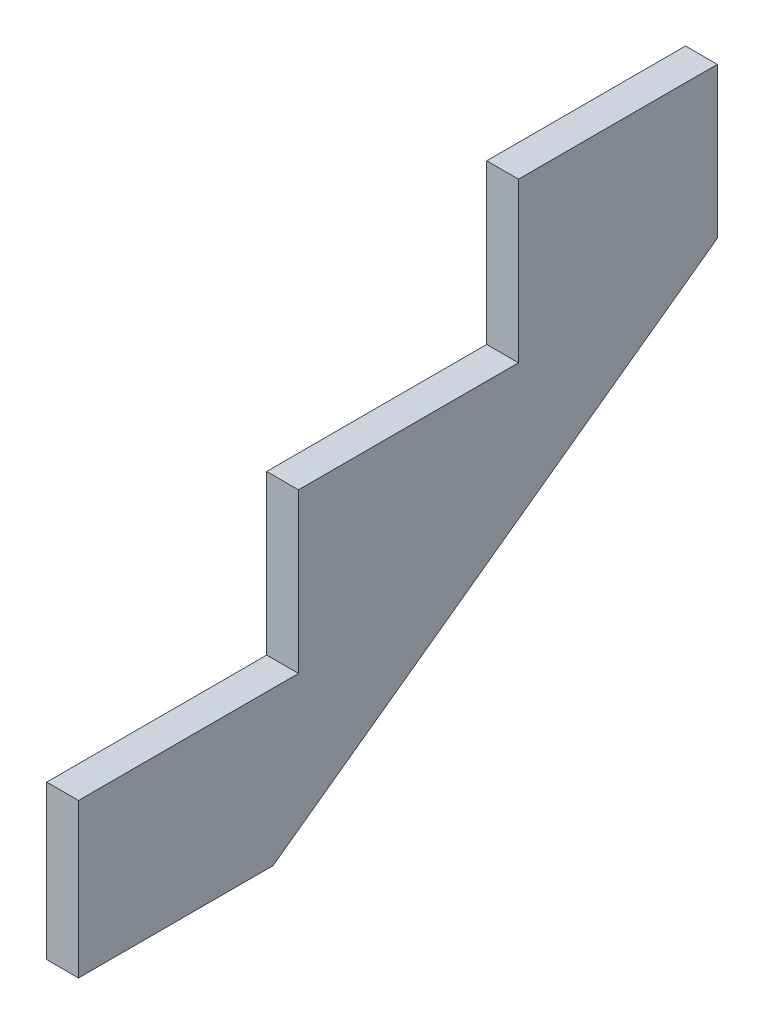
ISO-10303-21;
HEADER;
FILE_DESCRIPTION(('STEP AP214'),'2;1');
FILE_NAME('part.step','',(''),(''),'','','');
FILE_SCHEMA(('AUTOMOTIVE_DESIGN { 1 0 10303 214 1 1 1 1 }'));
ENDSEC;
DATA;
#1=APPLICATION_CONTEXT('core data for automotive mechanical design processes');
#2=APPLICATION_PROTOCOL_DEFINITION('international standard','automotive_design',2000,#1);
#3=PRODUCT_CONTEXT('',#1,'mechanical');
#4=PRODUCT('Part','Part','',(#3));
#5=PRODUCT_RELATED_PRODUCT_CATEGORY('part','',(#4));
#6=PRODUCT_DEFINITION_FORMATION('','',#4);
#7=PRODUCT_DEFINITION_CONTEXT('part definition',#1,'design');
#8=PRODUCT_DEFINITION('design','',#6,#7);
#9=PRODUCT_DEFINITION_SHAPE('','',#8);
#10=(LENGTH_UNIT() NAMED_UNIT(*) SI_UNIT(.MILLI.,.METRE.));
#11=(NAMED_UNIT(*) PLANE_ANGLE_UNIT() SI_UNIT($,.RADIAN.));
#12=(NAMED_UNIT(*) SI_UNIT($,.STERADIAN.) SOLID_ANGLE_UNIT());
#13=UNCERTAINTY_MEASURE_WITH_UNIT(LENGTH_MEASURE(1.E-05),#10,'distance_accuracy_value','');
#14=(GEOMETRIC_REPRESENTATION_CONTEXT(3) GLOBAL_UNCERTAINTY_ASSIGNED_CONTEXT((#13)) GLOBAL_UNIT_ASSIGNED_CONTEXT((#10,
#11,#12)) REPRESENTATION_CONTEXT('',''));
#15=CARTESIAN_POINT('',(0.,0.,0.));
#16=DIRECTION('',(0.,0.,1.));
#17=DIRECTION('',(1.,0.,0.));
#18=AXIS2_PLACEMENT_3D('',#15,#16,#17);
#19=CARTESIAN_POINT('',(38.1,0.,0.));
#20=DIRECTION('',(0.,0.,1.));
#21=DIRECTION('',(1.,0.,0.));
#22=AXIS2_PLACEMENT_3D('',#19,#20,#21);
#23=PLANE('',#22);
#24=DIRECTION('',(0.,1.,0.));
#25=VECTOR('',#24,1.);
#26=CARTESIAN_POINT('',(0.,0.,0.));
#27=LINE('',#26,#25);
#28=CARTESIAN_POINT('',(0.,0.,0.));
#29=VERTEX_POINT('',#28);
#30=CARTESIAN_POINT('',(0.,184.15,0.));
#31=VERTEX_POINT('',#30);
#32=EDGE_CURVE('E134',#29,#31,#27,.T.);
#33=ORIENTED_EDGE('',*,*,#32,.F.);
#34=DIRECTION('',(-1.,0.,0.));
#35=VECTOR('',#34,1.);
#36=CARTESIAN_POINT('',(38.1,0.,0.));
#37=LINE('',#36,#35);
#38=CARTESIAN_POINT('',(38.1,0.,0.));
#39=VERTEX_POINT('',#38);
#40=EDGE_CURVE('E11',#39,#29,#37,.T.);
#41=ORIENTED_EDGE('',*,*,#40,.F.);
#42=DIRECTION('',(0.,1.,0.));
#43=VECTOR('',#42,1.);
#44=CARTESIAN_POINT('',(38.1,0.,0.));
#45=LINE('',#44,#43);
#46=CARTESIAN_POINT('',(38.1,184.15,0.));
#47=VERTEX_POINT('',#46);
#48=EDGE_CURVE('E156',#39,#47,#45,.T.);
#49=ORIENTED_EDGE('',*,*,#48,.T.);
#50=DIRECTION('',(-1.,0.,0.));
#51=VECTOR('',#50,1.);
#52=CARTESIAN_POINT('',(38.1,184.15,0.));
#53=LINE('',#52,#51);
#54=EDGE_CURVE('E51',#47,#31,#53,.T.);
#55=ORIENTED_EDGE('',*,*,#54,.T.);
#56=EDGE_LOOP('',(#33,#41,#49,#55));
#57=FACE_BOUND('',#56,.T.);
#58=ADVANCED_FACE('F35',(#57),#23,.T.);
#59=CARTESIAN_POINT('',(38.1,0.,0.));
#60=DIRECTION('',(0.,1.,0.));
#61=DIRECTION('',(0.,0.,1.));
#62=AXIS2_PLACEMENT_3D('',#59,#60,#61);
#63=PLANE('',#62);
#64=DIRECTION('',(0.,0.,-1.));
#65=VECTOR('',#64,1.);
#66=CARTESIAN_POINT('',(0.,0.,0.));
#67=LINE('',#66,#65);
#68=CARTESIAN_POINT('',(0.,0.,-233.014505085684));
#69=VERTEX_POINT('',#68);
#70=EDGE_CURVE('E136',#29,#69,#67,.T.);
#71=ORIENTED_EDGE('',*,*,#70,.T.);
#72=DIRECTION('',(-1.,0.,0.));
#73=VECTOR('',#72,1.);
#74=CARTESIAN_POINT('',(38.1,0.,-233.014505085684));
#75=LINE('',#74,#73);
#76=CARTESIAN_POINT('',(38.1,0.,-233.014505085684));
#77=VERTEX_POINT('',#76);
#78=EDGE_CURVE('E43',#77,#69,#75,.T.);
#79=ORIENTED_EDGE('',*,*,#78,.F.);
#80=DIRECTION('',(0.,0.,-1.));
#81=VECTOR('',#80,1.);
#82=CARTESIAN_POINT('',(38.1,0.,0.));
#83=LINE('',#82,#81);
#84=EDGE_CURVE('E188',#39,#77,#83,.T.);
#85=ORIENTED_EDGE('',*,*,#84,.F.);
#86=ORIENTED_EDGE('',*,*,#40,.T.);
#87=EDGE_LOOP('',(#71,#79,#85,#86));
#88=FACE_BOUND('',#87,.T.);
#89=ADVANCED_FACE('F206',(#88),#63,.F.);
#90=CARTESIAN_POINT('',(38.1,-110.631350493537,-79.9744702362916));
#91=DIRECTION('',(0.,0.810421678379293,0.585846996418766));
#92=DIRECTION('',(0.,-0.585846996418766,0.810421678379293));
#93=AXIS2_PLACEMENT_3D('',#90,#91,#92);
#94=PLANE('',#93);
#95=DIRECTION('',(0.,0.585846996418766,-0.810421678379293));
#96=VECTOR('',#95,1.);
#97=CARTESIAN_POINT('',(0.,-110.631350493537,-79.9744702362916));
#98=LINE('',#97,#96);
#99=CARTESIAN_POINT('',(0.,384.694333673,-765.175));
#100=VERTEX_POINT('',#99);
#101=EDGE_CURVE('E138',#69,#100,#98,.T.);
#102=ORIENTED_EDGE('',*,*,#101,.T.);
#103=DIRECTION('',(-1.,0.,0.));
#104=VECTOR('',#103,1.);
#105=CARTESIAN_POINT('',(38.1,384.694333673,-765.175));
#106=LINE('',#105,#104);
#107=CARTESIAN_POINT('',(38.1,384.694333673,-765.175));
#108=VERTEX_POINT('',#107);
#109=EDGE_CURVE('E164',#108,#100,#106,.T.);
#110=ORIENTED_EDGE('',*,*,#109,.F.);
#111=DIRECTION('',(0.,0.585846996418766,-0.810421678379293));
#112=VECTOR('',#111,1.);
#113=CARTESIAN_POINT('',(38.1,-110.631350493537,-79.9744702362916));
#114=LINE('',#113,#112);
#115=EDGE_CURVE('E172',#77,#108,#114,.T.);
#116=ORIENTED_EDGE('',*,*,#115,.F.);
#117=ORIENTED_EDGE('',*,*,#78,.T.);
#118=EDGE_LOOP('',(#102,#110,#116,#117));
#119=FACE_BOUND('',#118,.T.);
#120=ADVANCED_FACE('F170',(#119),#94,.F.);
#121=CARTESIAN_POINT('',(38.1,-4.70761001945023E-13,-765.175));
#122=DIRECTION('',(0.,0.,-1.));
#123=DIRECTION('',(0.,1.,0.));
#124=AXIS2_PLACEMENT_3D('',#121,#122,#123);
#125=PLANE('',#124);
#126=DIRECTION('',(0.,-1.,0.));
#127=VECTOR('',#126,1.);
#128=CARTESIAN_POINT('',(0.,-4.70761001945023E-13,-765.175));
#129=LINE('',#128,#127);
#130=CARTESIAN_POINT('',(0.,565.15,-765.175));
#131=VERTEX_POINT('',#130);
#132=EDGE_CURVE('E141',#131,#100,#129,.T.);
#133=ORIENTED_EDGE('',*,*,#132,.F.);
#134=DIRECTION('',(-1.,0.,0.));
#135=VECTOR('',#134,1.);
#136=CARTESIAN_POINT('',(38.1,565.15,-765.175));
#137=LINE('',#136,#135);
#138=CARTESIAN_POINT('',(38.1,565.15,-765.175));
#139=VERTEX_POINT('',#138);
#140=EDGE_CURVE('E162',#139,#131,#137,.T.);
#141=ORIENTED_EDGE('',*,*,#140,.F.);
#142=DIRECTION('',(0.,-1.,0.));
#143=VECTOR('',#142,1.);
#144=CARTESIAN_POINT('',(38.1,-4.70761001945023E-13,-765.175));
#145=LINE('',#144,#143);
#146=EDGE_CURVE('E184',#139,#108,#145,.T.);
#147=ORIENTED_EDGE('',*,*,#146,.T.);
#148=ORIENTED_EDGE('',*,*,#109,.T.);
#149=EDGE_LOOP('',(#133,#141,#147,#148));
#150=FACE_BOUND('',#149,.T.);
#151=ADVANCED_FACE('F180',(#150),#125,.T.);
#152=CARTESIAN_POINT('',(38.1,565.15,0.));
#153=DIRECTION('',(0.,-1.,0.));
#154=DIRECTION('',(0.,0.,-1.));
#155=AXIS2_PLACEMENT_3D('',#152,#153,#154);
#156=PLANE('',#155);
#157=DIRECTION('',(0.,0.,1.));
#158=VECTOR('',#157,1.);
#159=CARTESIAN_POINT('',(0.,565.15,0.));
#160=LINE('',#159,#158);
#161=CARTESIAN_POINT('',(0.,565.15,-527.05));
#162=VERTEX_POINT('',#161);
#163=EDGE_CURVE('E144',#131,#162,#160,.T.);
#164=ORIENTED_EDGE('',*,*,#163,.T.);
#165=DIRECTION('',(-1.,0.,0.));
#166=VECTOR('',#165,1.);
#167=CARTESIAN_POINT('',(38.1,565.15,-527.05));
#168=LINE('',#167,#166);
#169=CARTESIAN_POINT('',(38.1,565.15,-527.05));
#170=VERTEX_POINT('',#169);
#171=EDGE_CURVE('E160',#170,#162,#168,.T.);
#172=ORIENTED_EDGE('',*,*,#171,.F.);
#173=DIRECTION('',(0.,0.,1.));
#174=VECTOR('',#173,1.);
#175=CARTESIAN_POINT('',(38.1,565.15,0.));
#176=LINE('',#175,#174);
#177=EDGE_CURVE('E185',#139,#170,#176,.T.);
#178=ORIENTED_EDGE('',*,*,#177,.F.);
#179=ORIENTED_EDGE('',*,*,#140,.T.);
#180=EDGE_LOOP('',(#164,#172,#178,#179));
#181=FACE_BOUND('',#180,.T.);
#182=ADVANCED_FACE('F217',(#181),#156,.F.);
#183=CARTESIAN_POINT('',(38.1,0.,-527.05));
#184=DIRECTION('',(0.,0.,1.));
#185=DIRECTION('',(1.,0.,0.));
#186=AXIS2_PLACEMENT_3D('',#183,#184,#185);
#187=PLANE('',#186);
#188=DIRECTION('',(0.,1.,0.));
#189=VECTOR('',#188,1.);
#190=CARTESIAN_POINT('',(0.,0.,-527.05));
#191=LINE('',#190,#189);
#192=CARTESIAN_POINT('',(0.,374.65,-527.05));
#193=VERTEX_POINT('',#192);
#194=EDGE_CURVE('E147',#193,#162,#191,.T.);
#195=ORIENTED_EDGE('',*,*,#194,.F.);
#196=DIRECTION('',(-1.,0.,0.));
#197=VECTOR('',#196,1.);
#198=CARTESIAN_POINT('',(38.1,374.65,-527.05));
#199=LINE('',#198,#197);
#200=CARTESIAN_POINT('',(38.1,374.65,-527.05));
#201=VERTEX_POINT('',#200);
#202=EDGE_CURVE('E116',#201,#193,#199,.T.);
#203=ORIENTED_EDGE('',*,*,#202,.F.);
#204=DIRECTION('',(0.,1.,0.));
#205=VECTOR('',#204,1.);
#206=CARTESIAN_POINT('',(38.1,0.,-527.05));
#207=LINE('',#206,#205);
#208=EDGE_CURVE('E126',#201,#170,#207,.T.);
#209=ORIENTED_EDGE('',*,*,#208,.T.);
#210=ORIENTED_EDGE('',*,*,#171,.T.);
#211=EDGE_LOOP('',(#195,#203,#209,#210));
#212=FACE_BOUND('',#211,.T.);
#213=ADVANCED_FACE('F193',(#212),#187,.T.);
#214=CARTESIAN_POINT('',(38.1,374.65,0.));
#215=DIRECTION('',(0.,1.,0.));
#216=DIRECTION('',(0.,0.,1.));
#217=AXIS2_PLACEMENT_3D('',#214,#215,#216);
#218=PLANE('',#217);
#219=DIRECTION('',(0.,0.,-1.));
#220=VECTOR('',#219,1.);
#221=CARTESIAN_POINT('',(0.,374.65,0.));
#222=LINE('',#221,#220);
#223=CARTESIAN_POINT('',(0.,374.65,-263.525));
#224=VERTEX_POINT('',#223);
#225=EDGE_CURVE('E112',#224,#193,#222,.T.);
#226=ORIENTED_EDGE('',*,*,#225,.F.);
#227=DIRECTION('',(-1.,0.,0.));
#228=VECTOR('',#227,1.);
#229=CARTESIAN_POINT('',(38.1,374.65,-263.525));
#230=LINE('',#229,#228);
#231=CARTESIAN_POINT('',(38.1,374.65,-263.525));
#232=VERTEX_POINT('',#231);
#233=EDGE_CURVE('E107',#232,#224,#230,.T.);
#234=ORIENTED_EDGE('',*,*,#233,.F.);
#235=DIRECTION('',(0.,0.,-1.));
#236=VECTOR('',#235,1.);
#237=CARTESIAN_POINT('',(38.1,374.65,0.));
#238=LINE('',#237,#236);
#239=EDGE_CURVE('E110',#232,#201,#238,.T.);
#240=ORIENTED_EDGE('',*,*,#239,.T.);
#241=ORIENTED_EDGE('',*,*,#202,.T.);
#242=EDGE_LOOP('',(#226,#234,#240,#241));
#243=FACE_BOUND('',#242,.T.);
#244=ADVANCED_FACE('F109',(#243),#218,.T.);
#245=CARTESIAN_POINT('',(38.1,0.,-263.525));
#246=DIRECTION('',(0.,0.,1.));
#247=DIRECTION('',(1.,0.,0.));
#248=AXIS2_PLACEMENT_3D('',#245,#246,#247);
#249=PLANE('',#248);
#250=DIRECTION('',(0.,1.,0.));
#251=VECTOR('',#250,1.);
#252=CARTESIAN_POINT('',(0.,0.,-263.525));
#253=LINE('',#252,#251);
#254=CARTESIAN_POINT('',(0.,184.15,-263.525));
#255=VERTEX_POINT('',#254);
#256=EDGE_CURVE('E151',#255,#224,#253,.T.);
#257=ORIENTED_EDGE('',*,*,#256,.F.);
#258=DIRECTION('',(-1.,0.,0.));
#259=VECTOR('',#258,1.);
#260=CARTESIAN_POINT('',(38.1,184.15,-263.525));
#261=LINE('',#260,#259);
#262=CARTESIAN_POINT('',(38.1,184.15,-263.525));
#263=VERTEX_POINT('',#262);
#264=EDGE_CURVE('E79',#263,#255,#261,.T.);
#265=ORIENTED_EDGE('',*,*,#264,.F.);
#266=DIRECTION('',(0.,1.,0.));
#267=VECTOR('',#266,1.);
#268=CARTESIAN_POINT('',(38.1,0.,-263.525));
#269=LINE('',#268,#267);
#270=EDGE_CURVE('E124',#263,#232,#269,.T.);
#271=ORIENTED_EDGE('',*,*,#270,.T.);
#272=ORIENTED_EDGE('',*,*,#233,.T.);
#273=EDGE_LOOP('',(#257,#265,#271,#272));
#274=FACE_BOUND('',#273,.T.);
#275=ADVANCED_FACE('F128',(#274),#249,.T.);
#276=CARTESIAN_POINT('',(38.1,184.15,0.));
#277=DIRECTION('',(0.,1.,0.));
#278=DIRECTION('',(0.,0.,1.));
#279=AXIS2_PLACEMENT_3D('',#276,#277,#278);
#280=PLANE('',#279);
#281=DIRECTION('',(0.,0.,-1.));
#282=VECTOR('',#281,1.);
#283=CARTESIAN_POINT('',(0.,184.15,0.));
#284=LINE('',#283,#282);
#285=EDGE_CURVE('E153',#31,#255,#284,.T.);
#286=ORIENTED_EDGE('',*,*,#285,.F.);
#287=ORIENTED_EDGE('',*,*,#54,.F.);
#288=DIRECTION('',(0.,0.,-1.));
#289=VECTOR('',#288,1.);
#290=CARTESIAN_POINT('',(38.1,184.15,0.));
#291=LINE('',#290,#289);
#292=EDGE_CURVE('E129',#47,#263,#291,.T.);
#293=ORIENTED_EDGE('',*,*,#292,.T.);
#294=ORIENTED_EDGE('',*,*,#264,.T.);
#295=EDGE_LOOP('',(#286,#287,#293,#294));
#296=FACE_BOUND('',#295,.T.);
#297=ADVANCED_FACE('F195',(#296),#280,.T.);
#298=CARTESIAN_POINT('',(38.1,0.,0.));
#299=DIRECTION('',(1.,0.,0.));
#300=DIRECTION('',(0.,0.,-1.));
#301=AXIS2_PLACEMENT_3D('',#298,#299,#300);
#302=PLANE('',#301);
#303=ORIENTED_EDGE('',*,*,#48,.F.);
#304=ORIENTED_EDGE('',*,*,#84,.T.);
#305=ORIENTED_EDGE('',*,*,#115,.T.);
#306=ORIENTED_EDGE('',*,*,#146,.F.);
#307=ORIENTED_EDGE('',*,*,#177,.T.);
#308=ORIENTED_EDGE('',*,*,#208,.F.);
#309=ORIENTED_EDGE('',*,*,#239,.F.);
#310=ORIENTED_EDGE('',*,*,#270,.F.);
#311=ORIENTED_EDGE('',*,*,#292,.F.);
#312=EDGE_LOOP('',(#303,#304,#305,#306,#307,#308,#309,#310,#311));
#313=FACE_BOUND('',#312,.T.);
#314=ADVANCED_FACE('F122',(#313),#302,.T.);
#315=CARTESIAN_POINT('',(0.,0.,0.));
#316=DIRECTION('',(1.,0.,0.));
#317=DIRECTION('',(0.,0.,-1.));
#318=AXIS2_PLACEMENT_3D('',#315,#316,#317);
#319=PLANE('',#318);
#320=ORIENTED_EDGE('',*,*,#32,.T.);
#321=ORIENTED_EDGE('',*,*,#285,.T.);
#322=ORIENTED_EDGE('',*,*,#256,.T.);
#323=ORIENTED_EDGE('',*,*,#225,.T.);
#324=ORIENTED_EDGE('',*,*,#194,.T.);
#325=ORIENTED_EDGE('',*,*,#163,.F.);
#326=ORIENTED_EDGE('',*,*,#132,.T.);
#327=ORIENTED_EDGE('',*,*,#101,.F.);
#328=ORIENTED_EDGE('',*,*,#70,.F.);
#329=EDGE_LOOP('',(#320,#321,#322,#323,#324,#325,#326,#327,#328));
#330=FACE_BOUND('',#329,.T.);
#331=ADVANCED_FACE('F176',(#330),#319,.F.);
#332=CLOSED_SHELL('',(#58,#89,#120,#151,#182,#213,#244,#275,#297,#314,#331));
#333=MANIFOLD_SOLID_BREP('B2',#332);
#334=ADVANCED_BREP_SHAPE_REPRESENTATION('',(#18,#333),#14);
#335=SHAPE_DEFINITION_REPRESENTATION(#9,#334);
ENDSEC;
END-ISO-10303-21;
